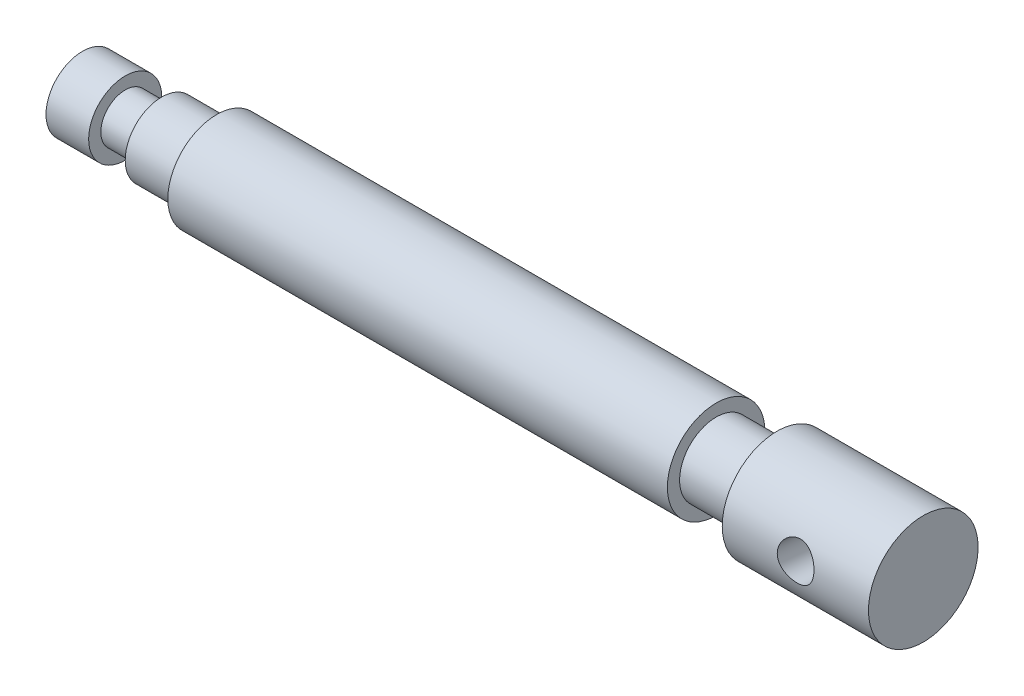
ISO-10303-21;
HEADER;
FILE_DESCRIPTION(('STEP AP214'),'2;1');
FILE_NAME('part.step','',(''),(''),'','','');
FILE_SCHEMA(('AUTOMOTIVE_DESIGN { 1 0 10303 214 1 1 1 1 }'));
ENDSEC;
DATA;
#1=APPLICATION_CONTEXT('core data for automotive mechanical design processes');
#2=APPLICATION_PROTOCOL_DEFINITION('international standard','automotive_design',2000,#1);
#3=PRODUCT_CONTEXT('',#1,'mechanical');
#4=PRODUCT('Part','Part','',(#3));
#5=PRODUCT_RELATED_PRODUCT_CATEGORY('part','',(#4));
#6=PRODUCT_DEFINITION_FORMATION('','',#4);
#7=PRODUCT_DEFINITION_CONTEXT('part definition',#1,'design');
#8=PRODUCT_DEFINITION('design','',#6,#7);
#9=PRODUCT_DEFINITION_SHAPE('','',#8);
#10=(LENGTH_UNIT() NAMED_UNIT(*) SI_UNIT(.MILLI.,.METRE.));
#11=(NAMED_UNIT(*) PLANE_ANGLE_UNIT() SI_UNIT($,.RADIAN.));
#12=(NAMED_UNIT(*) SI_UNIT($,.STERADIAN.) SOLID_ANGLE_UNIT());
#13=UNCERTAINTY_MEASURE_WITH_UNIT(LENGTH_MEASURE(1.E-05),#10,'distance_accuracy_value','');
#14=(GEOMETRIC_REPRESENTATION_CONTEXT(3) GLOBAL_UNCERTAINTY_ASSIGNED_CONTEXT((#13)) GLOBAL_UNIT_ASSIGNED_CONTEXT((#10,
#11,#12)) REPRESENTATION_CONTEXT('',''));
#15=CARTESIAN_POINT('',(0.,0.,0.));
#16=DIRECTION('',(0.,0.,1.));
#17=DIRECTION('',(1.,0.,0.));
#18=AXIS2_PLACEMENT_3D('',#15,#16,#17);
#19=CARTESIAN_POINT('',(0.,0.,0.));
#20=DIRECTION('',(1.,0.,0.));
#21=DIRECTION('',(0.,0.,-1.));
#22=AXIS2_PLACEMENT_3D('',#19,#20,#21);
#23=PLANE('',#22);
#24=CARTESIAN_POINT('',(0.,0.,0.));
#25=DIRECTION('',(-1.,0.,0.));
#26=DIRECTION('',(0.,0.,1.));
#27=AXIS2_PLACEMENT_3D('',#24,#25,#26);
#28=CIRCLE('',#27,6.);
#29=CARTESIAN_POINT('',(0.,0.,6.));
#30=VERTEX_POINT('',#29);
#31=EDGE_CURVE('E41',#30,#30,#28,.T.);
#32=ORIENTED_EDGE('',*,*,#31,.T.);
#33=EDGE_LOOP('',(#32));
#34=FACE_BOUND('',#33,.T.);
#35=ADVANCED_FACE('F31',(#34),#23,.F.);
#36=CARTESIAN_POINT('',(-8.88370642967452,0.,0.));
#37=DIRECTION('',(-1.,0.,0.));
#38=DIRECTION('',(0.,0.,1.));
#39=AXIS2_PLACEMENT_3D('',#36,#37,#38);
#40=CYLINDRICAL_SURFACE('',#39,6.);
#41=ORIENTED_EDGE('',*,*,#31,.F.);
#42=EDGE_LOOP('',(#41));
#43=FACE_BOUND('',#42,.T.);
#44=CARTESIAN_POINT('',(7.,0.,0.));
#45=DIRECTION('',(-1.,0.,0.));
#46=DIRECTION('',(0.,0.,1.));
#47=AXIS2_PLACEMENT_3D('',#44,#45,#46);
#48=CIRCLE('',#47,6.);
#49=CARTESIAN_POINT('',(7.,0.,6.));
#50=VERTEX_POINT('',#49);
#51=EDGE_CURVE('E45',#50,#50,#48,.T.);
#52=ORIENTED_EDGE('',*,*,#51,.T.);
#53=EDGE_LOOP('',(#52));
#54=FACE_BOUND('',#53,.T.);
#55=ADVANCED_FACE('F76',(#43,#54),#40,.T.);
#56=CARTESIAN_POINT('',(7.,6.,0.));
#57=DIRECTION('',(-1.,0.,0.));
#58=DIRECTION('',(0.,0.,1.));
#59=AXIS2_PLACEMENT_3D('',#56,#57,#58);
#60=PLANE('',#59);
#61=ORIENTED_EDGE('',*,*,#51,.F.);
#62=EDGE_LOOP('',(#61));
#63=FACE_BOUND('',#62,.T.);
#64=CARTESIAN_POINT('',(7.,0.,0.));
#65=DIRECTION('',(-1.,0.,0.));
#66=DIRECTION('',(0.,0.,1.));
#67=AXIS2_PLACEMENT_3D('',#64,#65,#66);
#68=CIRCLE('',#67,4.);
#69=CARTESIAN_POINT('',(7.,0.,4.));
#70=VERTEX_POINT('',#69);
#71=EDGE_CURVE('E50',#70,#70,#68,.T.);
#72=ORIENTED_EDGE('',*,*,#71,.T.);
#73=EDGE_LOOP('',(#72));
#74=FACE_BOUND('',#73,.T.);
#75=ADVANCED_FACE('F80',(#63,#74),#60,.F.);
#76=CARTESIAN_POINT('',(-8.88370642967452,0.,0.));
#77=DIRECTION('',(-1.,0.,0.));
#78=DIRECTION('',(0.,0.,1.));
#79=AXIS2_PLACEMENT_3D('',#76,#77,#78);
#80=CYLINDRICAL_SURFACE('',#79,4.);
#81=ORIENTED_EDGE('',*,*,#71,.F.);
#82=EDGE_LOOP('',(#81));
#83=FACE_BOUND('',#82,.T.);
#84=CARTESIAN_POINT('',(13.,0.,0.));
#85=DIRECTION('',(-1.,0.,0.));
#86=DIRECTION('',(0.,0.,1.));
#87=AXIS2_PLACEMENT_3D('',#84,#85,#86);
#88=CIRCLE('',#87,4.);
#89=CARTESIAN_POINT('',(13.,0.,4.));
#90=VERTEX_POINT('',#89);
#91=EDGE_CURVE('E148',#90,#90,#88,.T.);
#92=ORIENTED_EDGE('',*,*,#91,.T.);
#93=EDGE_LOOP('',(#92));
#94=FACE_BOUND('',#93,.T.);
#95=ADVANCED_FACE('F85',(#83,#94),#80,.T.);
#96=CARTESIAN_POINT('',(13.,4.,0.));
#97=DIRECTION('',(1.,0.,0.));
#98=DIRECTION('',(0.,0.,-1.));
#99=AXIS2_PLACEMENT_3D('',#96,#97,#98);
#100=PLANE('',#99);
#101=ORIENTED_EDGE('',*,*,#91,.F.);
#102=EDGE_LOOP('',(#101));
#103=FACE_BOUND('',#102,.T.);
#104=CARTESIAN_POINT('',(13.,0.,0.));
#105=DIRECTION('',(-1.,0.,0.));
#106=DIRECTION('',(0.,0.,1.));
#107=AXIS2_PLACEMENT_3D('',#104,#105,#106);
#108=CIRCLE('',#107,6.);
#109=CARTESIAN_POINT('',(13.,0.,6.));
#110=VERTEX_POINT('',#109);
#111=EDGE_CURVE('E145',#110,#110,#108,.T.);
#112=ORIENTED_EDGE('',*,*,#111,.T.);
#113=EDGE_LOOP('',(#112));
#114=FACE_BOUND('',#113,.T.);
#115=ADVANCED_FACE('F92',(#103,#114),#100,.F.);
#116=CARTESIAN_POINT('',(-8.88370642967452,0.,0.));
#117=DIRECTION('',(-1.,0.,0.));
#118=DIRECTION('',(0.,0.,1.));
#119=AXIS2_PLACEMENT_3D('',#116,#117,#118);
#120=CYLINDRICAL_SURFACE('',#119,6.);
#121=ORIENTED_EDGE('',*,*,#111,.F.);
#122=EDGE_LOOP('',(#121));
#123=FACE_BOUND('',#122,.T.);
#124=CARTESIAN_POINT('',(22.,0.,0.));
#125=DIRECTION('',(-1.,0.,0.));
#126=DIRECTION('',(0.,0.,1.));
#127=AXIS2_PLACEMENT_3D('',#124,#125,#126);
#128=CIRCLE('',#127,6.);
#129=CARTESIAN_POINT('',(22.,0.,6.));
#130=VERTEX_POINT('',#129);
#131=EDGE_CURVE('E142',#130,#130,#128,.T.);
#132=ORIENTED_EDGE('',*,*,#131,.T.);
#133=EDGE_LOOP('',(#132));
#134=FACE_BOUND('',#133,.T.);
#135=ADVANCED_FACE('F96',(#123,#134),#120,.T.);
#136=CARTESIAN_POINT('',(22.,6.,0.));
#137=DIRECTION('',(1.,0.,0.));
#138=DIRECTION('',(0.,0.,-1.));
#139=AXIS2_PLACEMENT_3D('',#136,#137,#138);
#140=PLANE('',#139);
#141=ORIENTED_EDGE('',*,*,#131,.F.);
#142=EDGE_LOOP('',(#141));
#143=FACE_BOUND('',#142,.T.);
#144=CARTESIAN_POINT('',(22.,0.,0.));
#145=DIRECTION('',(-1.,0.,0.));
#146=DIRECTION('',(0.,0.,1.));
#147=AXIS2_PLACEMENT_3D('',#144,#145,#146);
#148=CIRCLE('',#147,7.99999999999999);
#149=CARTESIAN_POINT('',(22.,0.,7.99999999999999));
#150=VERTEX_POINT('',#149);
#151=EDGE_CURVE('E139',#150,#150,#148,.T.);
#152=ORIENTED_EDGE('',*,*,#151,.T.);
#153=EDGE_LOOP('',(#152));
#154=FACE_BOUND('',#153,.T.);
#155=ADVANCED_FACE('F100',(#143,#154),#140,.F.);
#156=CARTESIAN_POINT('',(-8.88370642967452,0.,0.));
#157=DIRECTION('',(-1.,0.,0.));
#158=DIRECTION('',(0.,0.,1.));
#159=AXIS2_PLACEMENT_3D('',#156,#157,#158);
#160=CYLINDRICAL_SURFACE('',#159,7.99999999999999);
#161=ORIENTED_EDGE('',*,*,#151,.F.);
#162=EDGE_LOOP('',(#161));
#163=FACE_BOUND('',#162,.T.);
#164=CARTESIAN_POINT('',(104.,0.,0.));
#165=DIRECTION('',(-1.,0.,0.));
#166=DIRECTION('',(0.,0.,1.));
#167=AXIS2_PLACEMENT_3D('',#164,#165,#166);
#168=CIRCLE('',#167,7.99999999999999);
#169=CARTESIAN_POINT('',(104.,0.,7.99999999999999));
#170=VERTEX_POINT('',#169);
#171=EDGE_CURVE('E136',#170,#170,#168,.T.);
#172=ORIENTED_EDGE('',*,*,#171,.T.);
#173=EDGE_LOOP('',(#172));
#174=FACE_BOUND('',#173,.T.);
#175=ADVANCED_FACE('F104',(#163,#174),#160,.T.);
#176=CARTESIAN_POINT('',(104.,7.99999999999999,0.));
#177=DIRECTION('',(-1.,0.,0.));
#178=DIRECTION('',(0.,0.,1.));
#179=AXIS2_PLACEMENT_3D('',#176,#177,#178);
#180=PLANE('',#179);
#181=ORIENTED_EDGE('',*,*,#171,.F.);
#182=EDGE_LOOP('',(#181));
#183=FACE_BOUND('',#182,.T.);
#184=CARTESIAN_POINT('',(104.,0.,0.));
#185=DIRECTION('',(-1.,0.,0.));
#186=DIRECTION('',(0.,0.,1.));
#187=AXIS2_PLACEMENT_3D('',#184,#185,#186);
#188=CIRCLE('',#187,6.);
#189=CARTESIAN_POINT('',(104.,0.,6.));
#190=VERTEX_POINT('',#189);
#191=EDGE_CURVE('E129',#190,#190,#188,.T.);
#192=ORIENTED_EDGE('',*,*,#191,.T.);
#193=EDGE_LOOP('',(#192));
#194=FACE_BOUND('',#193,.T.);
#195=ADVANCED_FACE('F108',(#183,#194),#180,.F.);
#196=CARTESIAN_POINT('',(-8.88370642967452,0.,0.));
#197=DIRECTION('',(-1.,0.,0.));
#198=DIRECTION('',(0.,0.,1.));
#199=AXIS2_PLACEMENT_3D('',#196,#197,#198);
#200=CYLINDRICAL_SURFACE('',#199,6.);
#201=ORIENTED_EDGE('',*,*,#191,.F.);
#202=EDGE_LOOP('',(#201));
#203=FACE_BOUND('',#202,.T.);
#204=CARTESIAN_POINT('',(114.,0.,0.));
#205=DIRECTION('',(-1.,0.,0.));
#206=DIRECTION('',(0.,0.,1.));
#207=AXIS2_PLACEMENT_3D('',#204,#205,#206);
#208=CIRCLE('',#207,5.99999999999999);
#209=CARTESIAN_POINT('',(114.,0.,5.99999999999999));
#210=VERTEX_POINT('',#209);
#211=EDGE_CURVE('E123',#210,#210,#208,.T.);
#212=ORIENTED_EDGE('',*,*,#211,.T.);
#213=EDGE_LOOP('',(#212));
#214=FACE_BOUND('',#213,.T.);
#215=ADVANCED_FACE('F112',(#203,#214),#200,.T.);
#216=CARTESIAN_POINT('',(114.,5.99999999999999,0.));
#217=DIRECTION('',(1.,0.,0.));
#218=DIRECTION('',(0.,0.,-1.));
#219=AXIS2_PLACEMENT_3D('',#216,#217,#218);
#220=PLANE('',#219);
#221=ORIENTED_EDGE('',*,*,#211,.F.);
#222=EDGE_LOOP('',(#221));
#223=FACE_BOUND('',#222,.T.);
#224=CARTESIAN_POINT('',(114.,0.,0.));
#225=DIRECTION('',(-1.,0.,0.));
#226=DIRECTION('',(0.,0.,1.));
#227=AXIS2_PLACEMENT_3D('',#224,#225,#226);
#228=CIRCLE('',#227,9.);
#229=CARTESIAN_POINT('',(114.,0.,9.));
#230=VERTEX_POINT('',#229);
#231=EDGE_CURVE('E126',#230,#230,#228,.T.);
#232=ORIENTED_EDGE('',*,*,#231,.T.);
#233=EDGE_LOOP('',(#232));
#234=FACE_BOUND('',#233,.T.);
#235=ADVANCED_FACE('F73',(#223,#234),#220,.F.);
#236=CARTESIAN_POINT('',(-8.88370642967452,0.,0.));
#237=DIRECTION('',(-1.,0.,0.));
#238=DIRECTION('',(0.,0.,1.));
#239=AXIS2_PLACEMENT_3D('',#236,#237,#238);
#240=CYLINDRICAL_SURFACE('',#239,8.99999999999999);
#241=CARTESIAN_POINT('',(128.885407747774,0.,8.99999999999999));
#242=CARTESIAN_POINT('',(128.839151917214,-0.163194619583637,8.99999893585845));
#243=CARTESIAN_POINT('',(128.779223335395,-0.322531726551443,8.9955234363546));
#244=CARTESIAN_POINT('',(128.634114634647,-0.628888227257793,8.97931453638725));
#245=CARTESIAN_POINT('',(128.548921232083,-0.775901088917466,8.9675773143492));
#246=CARTESIAN_POINT('',(128.356037691408,-1.0534000146648,8.93922746648954));
#247=CARTESIAN_POINT('',(128.248386857256,-1.18391432121704,8.92262333820537));
#248=CARTESIAN_POINT('',(128.013299840894,-1.42536418068983,8.88725217243315));
#249=CARTESIAN_POINT('',(127.885862510511,-1.53629859662807,8.86848500944463));
#250=CARTESIAN_POINT('',(127.611084875949,-1.73788699241307,8.83122446631624));
#251=CARTESIAN_POINT('',(127.463349375196,-1.82800704263018,8.8127477066555));
#252=CARTESIAN_POINT('',(127.154206538027,-1.98155385869957,8.7795018866327));
#253=CARTESIAN_POINT('',(126.992802582669,-2.04498720279682,8.76473191291439));
#254=CARTESIAN_POINT('',(126.665549885657,-2.14132290347903,8.74169000279107));
#255=CARTESIAN_POINT('',(126.499949216694,-2.17502453110047,8.73324893386281));
#256=CARTESIAN_POINT('',(126.165231429709,-2.2133937179371,8.72360603075086));
#257=CARTESIAN_POINT('',(125.996115567413,-2.21807147234292,8.72240165454512));
#258=CARTESIAN_POINT('',(125.667986049675,-2.19869957369935,8.7273013915117));
#259=CARTESIAN_POINT('',(125.50888248436,-2.1760421708765,8.73305133891284));
#260=CARTESIAN_POINT('',(125.196802194449,-2.10522166246013,8.75039168545968));
#261=CARTESIAN_POINT('',(125.043826015685,-2.05705629001531,8.76198260367841));
#262=CARTESIAN_POINT('',(124.746620019258,-1.93641154521872,8.78943370600217));
#263=CARTESIAN_POINT('',(124.602481041174,-1.86371779639238,8.80533127970726));
#264=CARTESIAN_POINT('',(124.327805267905,-1.6963906552081,8.83909072289417));
#265=CARTESIAN_POINT('',(124.197272299751,-1.60175111405365,8.85695314214997));
#266=CARTESIAN_POINT('',(123.946296004663,-1.38758484526833,8.89308625102885));
#267=CARTESIAN_POINT('',(123.826736744244,-1.26701580570833,8.91132947532077));
#268=CARTESIAN_POINT('',(123.608862264147,-1.00756166902059,8.9443782201396));
#269=CARTESIAN_POINT('',(123.510550092891,-0.868673948219744,8.95918324739437));
#270=CARTESIAN_POINT('',(123.336485805985,-0.573753610596173,8.98292943747568));
#271=CARTESIAN_POINT('',(123.261136241007,-0.417474193335977,8.99176894353189));
#272=CARTESIAN_POINT('',(123.137826119916,-0.0942265647489397,9.00095631900297));
#273=CARTESIAN_POINT('',(123.089856639884,0.0727381441945581,9.00130695671744));
#274=CARTESIAN_POINT('',(123.024494915856,0.405297736369119,8.99234549136103));
#275=CARTESIAN_POINT('',(123.005946410271,0.570675794497741,8.98342291475));
#276=CARTESIAN_POINT('',(122.99649041175,0.901442397878997,8.95627797561553));
#277=CARTESIAN_POINT('',(123.00557723535,1.06683093398115,8.93805752592863));
#278=CARTESIAN_POINT('',(123.050246369515,1.38711212041556,8.89388549193038));
#279=CARTESIAN_POINT('',(123.084927682629,1.54217070422839,8.86821440593859));
#280=CARTESIAN_POINT('',(123.178527141865,1.8435239949838,8.81050363045794));
#281=CARTESIAN_POINT('',(123.237447797034,1.98981779287508,8.77846328185558));
#282=CARTESIAN_POINT('',(123.379179007348,2.27310162821815,8.70946192585909));
#283=CARTESIAN_POINT('',(123.462467560986,2.40983011373296,8.67241133162862));
#284=CARTESIAN_POINT('',(123.650095787944,2.66748809089035,8.59666044040818));
#285=CARTESIAN_POINT('',(123.754441711679,2.78841287395256,8.55795965629229));
#286=CARTESIAN_POINT('',(123.986966188374,3.01713199801678,8.48010597776847));
#287=CARTESIAN_POINT('',(124.116029989603,3.12404971589848,8.44101633413536));
#288=CARTESIAN_POINT('',(124.391263188078,3.31521035731792,8.3677887903986));
#289=CARTESIAN_POINT('',(124.537433834786,3.39945162311155,8.33365125239879));
#290=CARTESIAN_POINT('',(124.843935062629,3.54328858178777,8.27352668068457));
#291=CARTESIAN_POINT('',(125.004330899877,3.60276272464698,8.24757999238401));
#292=CARTESIAN_POINT('',(125.334072385205,3.69445602050183,8.20692086752998));
#293=CARTESIAN_POINT('',(125.503413992533,3.7266873689429,8.19220340441533));
#294=CARTESIAN_POINT('',(125.837230695014,3.76179846549779,8.17613741596325));
#295=CARTESIAN_POINT('',(126.001531938317,3.76605173595582,8.17416337499641));
#296=CARTESIAN_POINT('',(126.328454204418,3.74869700658583,8.18213667534386));
#297=CARTESIAN_POINT('',(126.491075405788,3.7270917844089,8.1920827362324));
#298=CARTESIAN_POINT('',(126.805749436352,3.65969283487882,8.22240524025214));
#299=CARTESIAN_POINT('',(126.957966499384,3.61453543885429,8.2425068730612));
#300=CARTESIAN_POINT('',(127.252439582466,3.50180628024664,8.29102513157676));
#301=CARTESIAN_POINT('',(127.394693556975,3.43422993102956,8.31944345863327));
#302=CARTESIAN_POINT('',(127.671301784292,3.2753438976395,8.38329967090137));
#303=CARTESIAN_POINT('',(127.805126833102,3.18320679650105,8.41896929074423));
#304=CARTESIAN_POINT('',(128.055415887297,2.97878526277716,8.49344785916162));
#305=CARTESIAN_POINT('',(128.171875002604,2.86649517484841,8.53225768726013));
#306=CARTESIAN_POINT('',(128.389268652135,2.61893411263102,8.61154857645235));
#307=CARTESIAN_POINT('',(128.489313328722,2.48287896246259,8.65202928425118));
#308=CARTESIAN_POINT('',(128.664572386222,2.19471688969777,8.72957297363278));
#309=CARTESIAN_POINT('',(128.739788760161,2.04261125680583,8.76663622937032));
#310=CARTESIAN_POINT('',(128.86188057441,1.72885199938945,8.83382035790085));
#311=CARTESIAN_POINT('',(128.909186800215,1.56738818743711,8.86404206248595));
#312=CARTESIAN_POINT('',(128.975479605401,1.23748334697842,8.91607873977813));
#313=CARTESIAN_POINT('',(128.994481932626,1.0690462519588,8.9378983822461));
#314=CARTESIAN_POINT('',(129.002963570269,0.748596455296917,8.970102453709));
#315=CARTESIAN_POINT('',(128.995380193874,0.59675163062596,8.98145954946709));
#316=CARTESIAN_POINT('',(128.95732767648,0.295571937205719,8.99640902973119));
#317=CARTESIAN_POINT('',(128.926857177845,0.146237217890125,9.00000095356758));
#318=CARTESIAN_POINT('',(128.885407747774,0.,8.99999999999999));
#319=B_SPLINE_CURVE_WITH_KNOTS('',3,(#241,#242,#243,#244,#245,#246,#247,#248,#249,#250,#251,
#252,#253,#254,#255,#256,#257,#258,#259,#260,#261,#262,#263,#264,#265,#266,#267,#268,#269,#270,
#271,#272,#273,#274,#275,#276,#277,#278,#279,#280,#281,#282,#283,#284,#285,#286,#287,#288,#289,
#290,#291,#292,#293,#294,#295,#296,#297,#298,#299,#300,#301,#302,#303,#304,#305,#306,#307,#308,
#309,#310,#311,#312,#313,#314,#315,#316,#317,#318),.UNSPECIFIED.,.T.,.F.,(4,2,2,2,2,2,2,2,2,2,2,
2,2,2,2,2,2,2,2,2,2,2,2,2,2,2,2,2,2,2,2,2,2,2,2,2,2,2,4),(0.,0.508291804398829,1.01685133167424,
1.5245281584972,2.03223445585258,2.55179365146119,3.07122470112926,3.57622454225086,
4.0810469824714,4.56120743573622,5.04141056723283,5.52592430157218,6.0105739518832,
6.52055715706312,7.0306134835071,7.54915575970413,8.0675289321213,8.56497467679971,
9.06231812399441,9.54294183300669,10.023615304551,10.5144344374247,11.0053994739644,
11.5192867043508,12.0332114918612,12.5496295700449,13.0658163470997,13.5564599094166,
14.0470507728253,14.5250253703967,15.0030978158844,15.499934323595,15.9969104724878,
16.5153920106852,17.0338319190143,17.5440450121606,18.0539741245549,18.5094227797802,
18.9648984538023),.UNSPECIFIED.);
#320=CARTESIAN_POINT('',(128.885407747774,0.,8.99999999999999));
#321=VERTEX_POINT('',#320);
#322=EDGE_CURVE('E10',#321,#321,#319,.T.);
#323=ORIENTED_EDGE('',*,*,#322,.T.);
#324=EDGE_LOOP('',(#323));
#325=FACE_BOUND('',#324,.T.);
#326=CARTESIAN_POINT('',(126.,-3.76174962560397,-8.17613843781209));
#327=CARTESIAN_POINT('',(126.163404524508,-3.76175034709765,-8.17613783112068));
#328=CARTESIAN_POINT('',(126.326804399471,-3.74884526918265,-8.18211256198892));
#329=CARTESIAN_POINT('',(126.648763262983,-3.69770136008115,-8.20535042934317));
#330=CARTESIAN_POINT('',(126.807321449617,-3.65945835580084,-8.22261542530183));
#331=CARTESIAN_POINT('',(127.114880678992,-3.55902285779865,-8.2665788877532));
#332=CARTESIAN_POINT('',(127.263899788328,-3.49687730019841,-8.29325885816211));
#333=CARTESIAN_POINT('',(127.549080145644,-3.35040282122792,-8.35350523983696));
#334=CARTESIAN_POINT('',(127.685238547661,-3.26606900534661,-8.38707317015893));
#335=CARTESIAN_POINT('',(127.946159887015,-3.07388412829418,-8.45943998061287));
#336=CARTESIAN_POINT('',(128.070346286015,-2.96530414902217,-8.49838231031122));
#337=CARTESIAN_POINT('',(128.298620403674,-2.72899867215622,-8.57718255222284));
#338=CARTESIAN_POINT('',(128.402704894747,-2.6012701058815,-8.61704061031881));
#339=CARTESIAN_POINT('',(128.590436691989,-2.32595969475318,-8.69545251886296));
#340=CARTESIAN_POINT('',(128.673479911854,-2.17794680533401,-8.73394520756265));
#341=CARTESIAN_POINT('',(128.812774755383,-1.86855679460672,-8.80531956172973));
#342=CARTESIAN_POINT('',(128.869033599531,-1.70718328881608,-8.83820273786401));
#343=CARTESIAN_POINT('',(128.951207563897,-1.38148452680075,-8.89482198251084));
#344=CARTESIAN_POINT('',(128.978110338771,-1.21745732723005,-8.91883650205262));
#345=CARTESIAN_POINT('',(129.003948880082,-0.886173521599596,-8.95781691144251));
#346=CARTESIAN_POINT('',(129.002891854957,-0.718917759021514,-8.97278513253845));
#347=CARTESIAN_POINT('',(128.973467236302,-0.3929078337401,-8.99284549763216));
#348=CARTESIAN_POINT('',(128.946172414577,-0.234077516788529,-8.998301965195));
#349=CARTESIAN_POINT('',(128.866821057059,0.0773281708771474,-9.00101551206569));
#350=CARTESIAN_POINT('',(128.814762843061,0.229903116905897,-8.99827203559993));
#351=CARTESIAN_POINT('',(128.686736048082,0.526716689071736,-8.98581901138436));
#352=CARTESIAN_POINT('',(128.61046218436,0.670819383761587,-8.97601837596694));
#353=CARTESIAN_POINT('',(128.436420883654,0.94492512276786,-8.95131744694747));
#354=CARTESIAN_POINT('',(128.338647470017,1.07492423139717,-8.93641573465637));
#355=CARTESIAN_POINT('',(128.118976819621,1.32343461254575,-8.90308844674441));
#356=CARTESIAN_POINT('',(127.996160526476,1.44111685287601,-8.88452999424401));
#357=CARTESIAN_POINT('',(127.73265382282,1.6544358695369,-8.8472931876044));
#358=CARTESIAN_POINT('',(127.591960662816,1.75006924833158,-8.82861481544179));
#359=CARTESIAN_POINT('',(127.29403912319,1.91754762187984,-8.79377403600655));
#360=CARTESIAN_POINT('',(127.136603606047,1.98903404293776,-8.77765129361778));
#361=CARTESIAN_POINT('',(126.811285817357,2.10360263314217,-8.75090611998701));
#362=CARTESIAN_POINT('',(126.643407956381,2.14669670650436,-8.74028138396711));
#363=CARTESIAN_POINT('',(126.310084933765,2.20137663380311,-8.72666624365043));
#364=CARTESIAN_POINT('',(126.144871725754,2.21429629597885,-8.72335303514619));
#365=CARTESIAN_POINT('',(125.814671552658,2.21200260653057,-8.72393552278673));
#366=CARTESIAN_POINT('',(125.649684551928,2.19679436467383,-8.72782990958644));
#367=CARTESIAN_POINT('',(125.330529102864,2.13991951099504,-8.74194158248602));
#368=CARTESIAN_POINT('',(125.176183709548,2.09917971098584,-8.7519370765868));
#369=CARTESIAN_POINT('',(124.876369181282,1.99361273240004,-8.77658396883558));
#370=CARTESIAN_POINT('',(124.730901625228,1.92878128365461,-8.79123619230752));
#371=CARTESIAN_POINT('',(124.447858737459,1.77468585473483,-8.82365340926474));
#372=CARTESIAN_POINT('',(124.310680072075,1.68471215098212,-8.84150239245634));
#373=CARTESIAN_POINT('',(124.052561842849,1.48390136472852,-8.87741090318914));
#374=CARTESIAN_POINT('',(123.931627084016,1.37305813212725,-8.89547049131868));
#375=CARTESIAN_POINT('',(123.703416047728,1.12753510506821,-8.92999064100021));
#376=CARTESIAN_POINT('',(123.597076829943,0.991965068531748,-8.94633246816345));
#377=CARTESIAN_POINT('',(123.408251572956,0.704604134139245,-8.97353508002439));
#378=CARTESIAN_POINT('',(123.325764686513,0.552813812693743,-8.98439605941326));
#379=CARTESIAN_POINT('',(123.187739685415,0.238264642174762,-8.99821210348968));
#380=CARTESIAN_POINT('',(123.132026168556,0.0755853663099408,-9.00121921436863));
#381=CARTESIAN_POINT('',(123.04881677382,-0.256733295832479,-8.99786924773598));
#382=CARTESIAN_POINT('',(123.021310710358,-0.426370146733011,-8.99151555239009));
#383=CARTESIAN_POINT('',(122.996213767183,-0.759161182794861,-8.96940251785235));
#384=CARTESIAN_POINT('',(122.997277638203,-0.922245326645866,-8.95409927796206));
#385=CARTESIAN_POINT('',(123.025971924439,-1.24499909160574,-8.91495362455319));
#386=CARTESIAN_POINT('',(123.053600184458,-1.40466898864186,-8.89111190386923));
#387=CARTESIAN_POINT('',(123.133746703728,-1.7136091315416,-8.83672910735825));
#388=CARTESIAN_POINT('',(123.185862646059,-1.86300427917757,-8.80630045751442));
#389=CARTESIAN_POINT('',(123.313132593291,-2.15046442834526,-8.74055307654675));
#390=CARTESIAN_POINT('',(123.388290765591,-2.28852737461402,-8.70523346148128));
#391=CARTESIAN_POINT('',(123.562708536306,-2.55510784063053,-8.6308336870545));
#392=CARTESIAN_POINT('',(123.662756056145,-2.68308417263143,-8.59166279832368));
#393=CARTESIAN_POINT('',(123.882772173469,-2.92079451467645,-8.51379082550551));
#394=CARTESIAN_POINT('',(124.002747126788,-3.03052268206899,-8.4750898955508));
#395=CARTESIAN_POINT('',(124.264828066761,-3.23318954254335,-8.39991908192666));
#396=CARTESIAN_POINT('',(124.40761653293,-3.32530286867111,-8.36359583584375));
#397=CARTESIAN_POINT('',(124.708003280708,-3.484697861844,-8.2984535594749));
#398=CARTESIAN_POINT('',(124.865597679089,-3.55198601723086,-8.26963256896951));
#399=CARTESIAN_POINT('',(125.183885472047,-3.65717902114354,-8.22363710422234));
#400=CARTESIAN_POINT('',(125.344116790576,-3.69627456272303,-8.2059950743701));
#401=CARTESIAN_POINT('',(125.6695681514,-3.74855502970551,-8.18224803840384));
#402=CARTESIAN_POINT('',(125.834786452232,-3.76174889612275,-8.17613905122008));
#403=CARTESIAN_POINT('',(126.,-3.76174962560397,-8.17613843781209));
#404=B_SPLINE_CURVE_WITH_KNOTS('',3,(#326,#327,#328,#329,#330,#331,#332,#333,#334,#335,#336,
#337,#338,#339,#340,#341,#342,#343,#344,#345,#346,#347,#348,#349,#350,#351,#352,#353,#354,#355,
#356,#357,#358,#359,#360,#361,#362,#363,#364,#365,#366,#367,#368,#369,#370,#371,#372,#373,#374,
#375,#376,#377,#378,#379,#380,#381,#382,#383,#384,#385,#386,#387,#388,#389,#390,#391,#392,#393,
#394,#395,#396,#397,#398,#399,#400,#401,#402,#403),.UNSPECIFIED.,.T.,.F.,(4,2,2,2,2,2,2,2,2,2,2,
2,2,2,2,2,2,2,2,2,2,2,2,2,2,2,2,2,2,2,2,2,2,2,2,2,2,2,4),(0.,0.489601754398035,
0.979284165045477,1.46800988250248,1.9568434985563,2.46304012282703,2.96931795515961,
3.48880518430969,4.00815229160365,4.50942956294801,5.01057759906981,5.49207014476707,
5.97359532567709,6.46144964581005,6.94943975622065,7.46040523091751,7.97144938836317,
8.48977919529164,9.00789154069848,9.50262874093317,9.99727607511701,10.4749318730633,
10.9526723744084,11.4455657320715,11.9386045698638,12.4553642451328,12.972105562726,
13.4854137357255,13.9985364901247,14.4875425403291,14.9765089202934,15.4577086812129,
15.9389955228973,16.438065585619,16.9372951329789,17.4560670820843,17.974703348006,
18.4698963648807,18.9649184157139),.UNSPECIFIED.);
#405=CARTESIAN_POINT('',(126.,-3.76174962560397,-8.17613843781209));
#406=VERTEX_POINT('',#405);
#407=EDGE_CURVE('E53',#406,#406,#404,.T.);
#408=ORIENTED_EDGE('',*,*,#407,.T.);
#409=EDGE_LOOP('',(#408));
#410=FACE_BOUND('',#409,.T.);
#411=ORIENTED_EDGE('',*,*,#231,.F.);
#412=EDGE_LOOP('',(#411));
#413=FACE_BOUND('',#412,.T.);
#414=CARTESIAN_POINT('',(138.,0.,0.));
#415=DIRECTION('',(-1.,0.,0.));
#416=DIRECTION('',(0.,0.,1.));
#417=AXIS2_PLACEMENT_3D('',#414,#415,#416);
#418=CIRCLE('',#417,8.99999999999999);
#419=CARTESIAN_POINT('',(138.,0.,8.99999999999999));
#420=VERTEX_POINT('',#419);
#421=EDGE_CURVE('E57',#420,#420,#418,.T.);
#422=ORIENTED_EDGE('',*,*,#421,.T.);
#423=EDGE_LOOP('',(#422));
#424=FACE_BOUND('',#423,.T.);
#425=ADVANCED_FACE('F58',(#325,#410,#413,#424),#240,.T.);
#426=CARTESIAN_POINT('',(138.,8.99999999999999,0.));
#427=DIRECTION('',(-1.,0.,0.));
#428=DIRECTION('',(0.,0.,1.));
#429=AXIS2_PLACEMENT_3D('',#426,#427,#428);
#430=PLANE('',#429);
#431=ORIENTED_EDGE('',*,*,#421,.F.);
#432=EDGE_LOOP('',(#431));
#433=FACE_BOUND('',#432,.T.);
#434=ADVANCED_FACE('F65',(#433),#430,.F.);
#435=CARTESIAN_POINT('',(126.,0.821232079916659,8.96245378626387));
#436=DIRECTION('',(0.,0.0912480088796288,0.995828198473764));
#437=DIRECTION('',(0.,-0.995828198473764,0.0912480088796288));
#438=AXIS2_PLACEMENT_3D('',#435,#436,#437);
#439=CYLINDRICAL_SURFACE('',#438,3.);
#440=ORIENTED_EDGE('',*,*,#407,.F.);
#441=EDGE_LOOP('',(#440));
#442=FACE_BOUND('',#441,.T.);
#443=ORIENTED_EDGE('',*,*,#322,.F.);
#444=EDGE_LOOP('',(#443));
#445=FACE_BOUND('',#444,.T.);
#446=ADVANCED_FACE('F62',(#442,#445),#439,.F.);
#447=CLOSED_SHELL('',(#35,#55,#75,#95,#115,#135,#155,#175,#195,#215,#235,#425,#434,#446));
#448=MANIFOLD_SOLID_BREP('B2',#447);
#449=ADVANCED_BREP_SHAPE_REPRESENTATION('',(#18,#448),#14);
#450=SHAPE_DEFINITION_REPRESENTATION(#9,#449);
ENDSEC;
END-ISO-10303-21;
